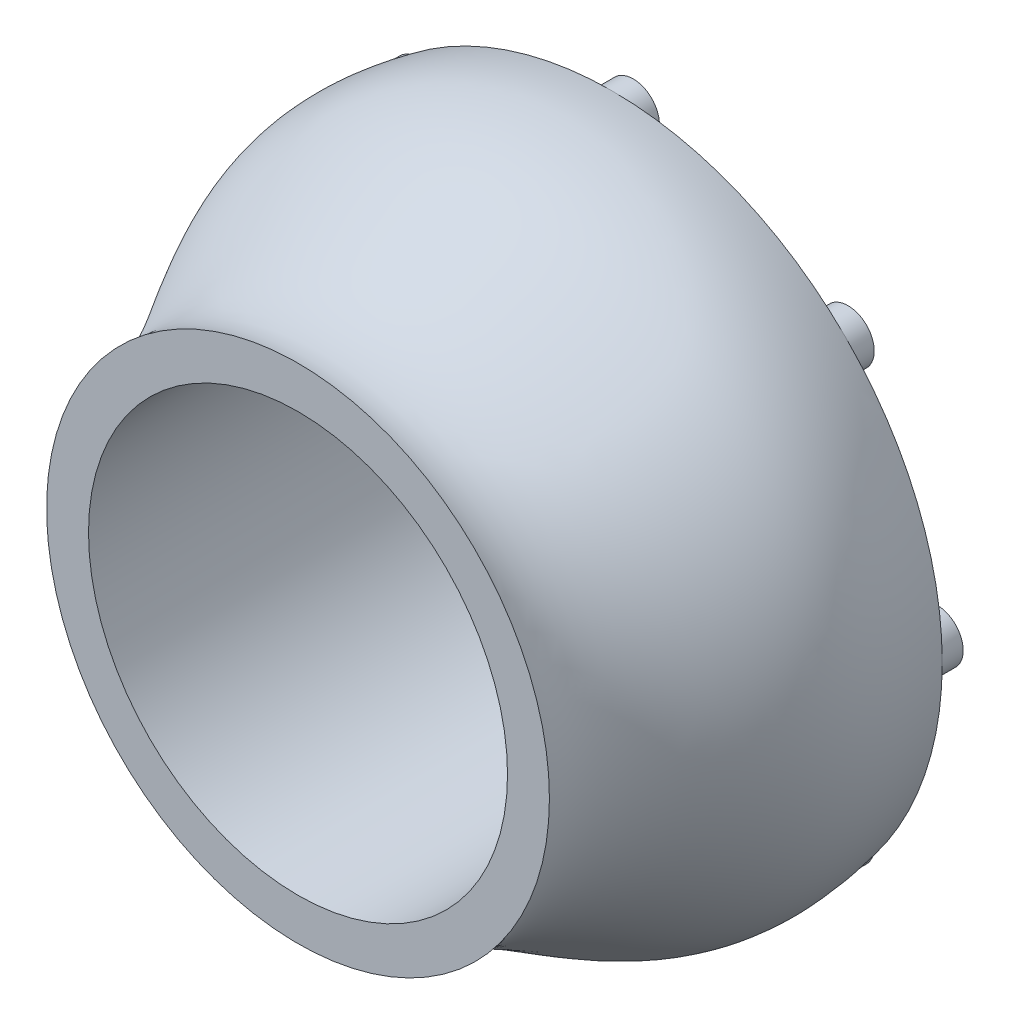
ISO-10303-21;
HEADER;
FILE_DESCRIPTION(('STEP AP214'),'2;1');
FILE_NAME('part.step','',(''),(''),'','','');
FILE_SCHEMA(('AUTOMOTIVE_DESIGN { 1 0 10303 214 1 1 1 1 }'));
ENDSEC;
DATA;
#1=APPLICATION_CONTEXT('core data for automotive mechanical design processes');
#2=APPLICATION_PROTOCOL_DEFINITION('international standard','automotive_design',2000,#1);
#3=PRODUCT_CONTEXT('',#1,'mechanical');
#4=PRODUCT('Part','Part','',(#3));
#5=PRODUCT_RELATED_PRODUCT_CATEGORY('part','',(#4));
#6=PRODUCT_DEFINITION_FORMATION('','',#4);
#7=PRODUCT_DEFINITION_CONTEXT('part definition',#1,'design');
#8=PRODUCT_DEFINITION('design','',#6,#7);
#9=PRODUCT_DEFINITION_SHAPE('','',#8);
#10=(LENGTH_UNIT() NAMED_UNIT(*) SI_UNIT(.MILLI.,.METRE.));
#11=(NAMED_UNIT(*) PLANE_ANGLE_UNIT() SI_UNIT($,.RADIAN.));
#12=(NAMED_UNIT(*) SI_UNIT($,.STERADIAN.) SOLID_ANGLE_UNIT());
#13=UNCERTAINTY_MEASURE_WITH_UNIT(LENGTH_MEASURE(1.E-05),#10,'distance_accuracy_value','');
#14=(GEOMETRIC_REPRESENTATION_CONTEXT(3) GLOBAL_UNCERTAINTY_ASSIGNED_CONTEXT((#13)) GLOBAL_UNIT_ASSIGNED_CONTEXT((#10,
#11,#12)) REPRESENTATION_CONTEXT('',''));
#15=CARTESIAN_POINT('',(0.,0.,0.));
#16=DIRECTION('',(0.,0.,1.));
#17=DIRECTION('',(1.,0.,0.));
#18=AXIS2_PLACEMENT_3D('',#15,#16,#17);
#19=CARTESIAN_POINT('',(0.,0.,0.));
#20=DIRECTION('',(0.,0.,1.));
#21=DIRECTION('',(1.,0.,0.));
#22=AXIS2_PLACEMENT_3D('',#19,#20,#21);
#23=PLANE('',#22);
#24=CARTESIAN_POINT('',(0.,0.,0.));
#25=DIRECTION('',(0.,0.,-1.));
#26=DIRECTION('',(-1.,0.,0.));
#27=AXIS2_PLACEMENT_3D('',#24,#25,#26);
#28=CIRCLE('',#27,20.);
#29=CARTESIAN_POINT('',(-20.,0.,0.));
#30=VERTEX_POINT('',#29);
#31=EDGE_CURVE('E412',#30,#30,#28,.T.);
#32=ORIENTED_EDGE('',*,*,#31,.F.);
#33=EDGE_LOOP('',(#32));
#34=FACE_BOUND('',#33,.T.);
#35=CARTESIAN_POINT('',(0.,0.,0.));
#36=DIRECTION('',(0.,0.,1.));
#37=DIRECTION('',(1.,0.,0.));
#38=AXIS2_PLACEMENT_3D('',#35,#36,#37);
#39=CIRCLE('',#38,31.5000000000018);
#40=CARTESIAN_POINT('',(22.2737929840219,22.2739342279094,0.));
#41=VERTEX_POINT('',#40);
#42=CARTESIAN_POINT('',(-4.33144647471246E-05,31.5000092623447,0.));
#43=VERTEX_POINT('',#42);
#44=EDGE_CURVE('E140',#41,#43,#39,.T.);
#45=ORIENTED_EDGE('',*,*,#44,.F.);
#46=CARTESIAN_POINT('',(20.5060966544095,20.506096654409,0.));
#47=DIRECTION('',(0.,0.,-1.));
#48=DIRECTION('',(-1.,0.,0.));
#49=AXIS2_PLACEMENT_3D('',#46,#47,#48);
#50=CIRCLE('',#49,2.50000000000095);
#51=EDGE_CURVE('E179',#41,#41,#50,.T.);
#52=ORIENTED_EDGE('',*,*,#51,.F.);
#53=CARTESIAN_POINT('',(31.4999999987557,7.88953098239609E-05,0.));
#54=VERTEX_POINT('',#53);
#55=EDGE_CURVE('E163',#54,#41,#39,.T.);
#56=ORIENTED_EDGE('',*,*,#55,.F.);
#57=CARTESIAN_POINT('',(28.9999999999988,-1.23456862236381E-12,0.));
#58=DIRECTION('',(0.,0.,-1.));
#59=DIRECTION('',(-1.,0.,0.));
#60=AXIS2_PLACEMENT_3D('',#57,#58,#59);
#61=CIRCLE('',#60,2.50000000000183);
#62=EDGE_CURVE('E397',#54,#54,#61,.T.);
#63=ORIENTED_EDGE('',*,*,#62,.F.);
#64=CARTESIAN_POINT('',(22.282916329209,-22.2647749915402,0.));
#65=VERTEX_POINT('',#64);
#66=EDGE_CURVE('E167',#65,#54,#39,.T.);
#67=ORIENTED_EDGE('',*,*,#66,.F.);
#68=CARTESIAN_POINT('',(20.5060966544078,-20.5060966544108,0.));
#69=DIRECTION('',(0.,0.,-1.));
#70=DIRECTION('',(-1.,0.,0.));
#71=AXIS2_PLACEMENT_3D('',#68,#69,#70);
#72=CIRCLE('',#71,2.50000000000251);
#73=CARTESIAN_POINT('',(22.264965307308,-22.2827276370392,0.));
#74=VERTEX_POINT('',#73);
#75=EDGE_CURVE('E353',#74,#65,#72,.T.);
#76=ORIENTED_EDGE('',*,*,#75,.F.);
#77=CARTESIAN_POINT('',(9.99348075282576E-05,-31.4999999980052,0.));
#78=VERTEX_POINT('',#77);
#79=EDGE_CURVE('E221',#78,#74,#39,.T.);
#80=ORIENTED_EDGE('',*,*,#79,.F.);
#81=CARTESIAN_POINT('',(-2.46203429329257E-12,-29.,0.));
#82=DIRECTION('',(0.,0.,-1.));
#83=DIRECTION('',(-1.,0.,0.));
#84=AXIS2_PLACEMENT_3D('',#81,#82,#83);
#85=CIRCLE('',#84,2.50000000000255);
#86=EDGE_CURVE('E356',#78,#78,#85,.T.);
#87=ORIENTED_EDGE('',*,*,#86,.F.);
#88=CARTESIAN_POINT('',(-22.2737929528265,-22.2739342591061,0.));
#89=VERTEX_POINT('',#88);
#90=EDGE_CURVE('E225',#89,#78,#39,.T.);
#91=ORIENTED_EDGE('',*,*,#90,.F.);
#92=CARTESIAN_POINT('',(-20.506096654412,-20.506096654409,0.));
#93=DIRECTION('',(0.,0.,-1.));
#94=DIRECTION('',(-1.,0.,0.));
#95=AXIS2_PLACEMENT_3D('',#92,#93,#94);
#96=CIRCLE('',#95,2.5000000000019);
#97=EDGE_CURVE('E373',#89,#89,#96,.T.);
#98=ORIENTED_EDGE('',*,*,#97,.F.);
#99=CARTESIAN_POINT('',(-31.5000068710482,-5.05668370192286E-05,0.));
#100=VERTEX_POINT('',#99);
#101=EDGE_CURVE('E392',#100,#89,#39,.T.);
#102=ORIENTED_EDGE('',*,*,#101,.F.);
#103=CARTESIAN_POINT('',(-29.0000000000012,1.23101714664628E-12,0.));
#104=DIRECTION('',(0.,0.,-1.));
#105=DIRECTION('',(-1.,0.,0.));
#106=AXIS2_PLACEMENT_3D('',#103,#104,#105);
#107=CIRCLE('',#106,2.50000000000092);
#108=EDGE_CURVE('E381',#100,#100,#107,.T.);
#109=ORIENTED_EDGE('',*,*,#108,.F.);
#110=CARTESIAN_POINT('',(-22.2739340583269,22.2737931536192,0.));
#111=VERTEX_POINT('',#110);
#112=EDGE_CURVE('E124',#111,#100,#39,.T.);
#113=ORIENTED_EDGE('',*,*,#112,.F.);
#114=CARTESIAN_POINT('',(-20.5060966544102,20.5060966544108,0.));
#115=DIRECTION('',(0.,0.,-1.));
#116=DIRECTION('',(-1.,0.,0.));
#117=AXIS2_PLACEMENT_3D('',#114,#115,#116);
#118=CIRCLE('',#117,2.50000000000014);
#119=EDGE_CURVE('E317',#111,#111,#118,.T.);
#120=ORIENTED_EDGE('',*,*,#119,.F.);
#121=EDGE_CURVE('E12',#43,#111,#39,.T.);
#122=ORIENTED_EDGE('',*,*,#121,.F.);
#123=CARTESIAN_POINT('',(0.,29.,0.));
#124=DIRECTION('',(0.,0.,-1.));
#125=DIRECTION('',(-1.,0.,0.));
#126=AXIS2_PLACEMENT_3D('',#123,#124,#125);
#127=CIRCLE('',#126,2.5);
#128=EDGE_CURVE('E181',#43,#43,#127,.T.);
#129=ORIENTED_EDGE('',*,*,#128,.F.);
#130=EDGE_LOOP('',(#45,#52,#56,#63,#67,#76,#80,#87,#91,#98,#102,#109,#113,#120,#122,#129));
#131=FACE_BOUND('',#130,.T.);
#132=ADVANCED_FACE('F115',(#34,#131),#23,.F.);
#133=CARTESIAN_POINT('',(0.,0.,30.));
#134=DIRECTION('',(0.,0.,1.));
#135=DIRECTION('',(1.,0.,0.));
#136=AXIS2_PLACEMENT_3D('',#133,#134,#135);
#137=PLANE('',#136);
#138=CARTESIAN_POINT('',(0.,0.,30.));
#139=DIRECTION('',(0.,0.,1.));
#140=DIRECTION('',(1.,0.,0.));
#141=AXIS2_PLACEMENT_3D('',#138,#139,#140);
#142=CIRCLE('',#141,20.);
#143=CARTESIAN_POINT('',(20.,0.,30.));
#144=VERTEX_POINT('',#143);
#145=EDGE_CURVE('E119',#144,#144,#142,.T.);
#146=ORIENTED_EDGE('',*,*,#145,.F.);
#147=EDGE_LOOP('',(#146));
#148=FACE_BOUND('',#147,.T.);
#149=CARTESIAN_POINT('',(0.,0.,30.));
#150=DIRECTION('',(0.,0.,1.));
#151=DIRECTION('',(1.,0.,0.));
#152=AXIS2_PLACEMENT_3D('',#149,#150,#151);
#153=CIRCLE('',#152,24.);
#154=CARTESIAN_POINT('',(24.,0.,30.));
#155=VERTEX_POINT('',#154);
#156=EDGE_CURVE('E182',#155,#155,#153,.T.);
#157=ORIENTED_EDGE('',*,*,#156,.T.);
#158=EDGE_LOOP('',(#157));
#159=FACE_BOUND('',#158,.T.);
#160=ADVANCED_FACE('F292',(#148,#159),#137,.T.);
#161=CARTESIAN_POINT('',(8.17226006122936,-22.5657742054563,30.));
#162=CARTESIAN_POINT('',(12.2462463436274,-20.3358943234867,27.1743109640882));
#163=CARTESIAN_POINT('',(18.3650531807604,-17.2462957535354,21.5574241412799));
#164=CARTESIAN_POINT('',(24.0696067194807,-21.9466994020287,10.4072407676802));
#165=CARTESIAN_POINT('',(23.0178719238098,-22.6190872167557,3.50927401928275));
#166=CARTESIAN_POINT('',(21.5845369252267,-22.9424882199738,0.));
#167=CARTESIAN_POINT('',(6.6953336825771,-23.1006473433217,30.));
#168=CARTESIAN_POINT('',(10.9152155212784,-21.137415561523,27.1743103825249));
#169=CARTESIAN_POINT('',(17.2363024765822,-18.4482840143075,21.5574242255509));
#170=CARTESIAN_POINT('',(22.6331967397162,-23.5220502971116,10.4072410201896));
#171=CARTESIAN_POINT('',(21.5374523240036,-24.1256064254355,3.50927343525123));
#172=CARTESIAN_POINT('',(20.0829546734728,-24.355192772701,0.));
#173=CARTESIAN_POINT('',(3.63629053057793,-23.8783004586063,30.));
#174=CARTESIAN_POINT('',(8.09562466375803,-22.4775851354522,27.1742960601731));
#175=CARTESIAN_POINT('',(14.7421419897276,-20.6299847146404,21.5574305598802));
#176=CARTESIAN_POINT('',(19.4501918653447,-26.3898344430555,10.4072366156752));
#177=CARTESIAN_POINT('',(18.2799934824636,-26.8470816844515,3.50927983101749));
#178=CARTESIAN_POINT('',(16.8016399288902,-26.88486639275,0.));
#179=CARTESIAN_POINT('',(-1.09252760508084,-24.1320104064838,30.));
#180=CARTESIAN_POINT('',(3.55446115438153,-23.6268861854048,27.1743235879626));
#181=CARTESIAN_POINT('',(10.4339668755966,-23.1095334472246,21.5574174867088));
#182=CARTESIAN_POINT('',(13.9280057862748,-29.6772929912708,10.407247322328));
#183=CARTESIAN_POINT('',(12.6910902467582,-29.8973774981688,3.50926315464398));
#184=CARTESIAN_POINT('',(11.2337536897232,-29.646067023508,0.));
#185=CARTESIAN_POINT('',(-5.77842933790616,-23.4508259107406,30.));
#186=CARTESIAN_POINT('',(-1.12243728734717,-23.8636660470968,27.1742982404886));
#187=CARTESIAN_POINT('',(5.7253675949735,-24.7008696007836,21.5574339554911));
#188=CARTESIAN_POINT('',(7.87061691961174,-31.8242979135194,10.4072264112701));
#189=CARTESIAN_POINT('',(6.61453189779017,-31.7989276377322,3.50930012873425));
#190=CARTESIAN_POINT('',(5.23427079203221,-31.2680462010341,0.));
#191=CARTESIAN_POINT('',(-10.2442406258479,-21.8775083764058,30.));
#192=CARTESIAN_POINT('',(-5.75782470993728,-23.1893238592667,27.1743690824351));
#193=CARTESIAN_POINT('',(0.795819482941087,-25.3443216265884,21.5573921275354));
#194=CARTESIAN_POINT('',(1.5108169227628,-32.7481170844811,10.4072743792576));
#195=CARTESIAN_POINT('',(0.283806229401346,-32.4781851243903,3.50921728130966));
#196=CARTESIAN_POINT('',(-0.966447136219214,-31.6883954191066,0.));
#197=CARTESIAN_POINT('',(-14.312787426856,-19.4548192085082,30.));
#198=CARTESIAN_POINT('',(-10.1689549686719,-21.6171225027547,27.1741426720217));
#199=CARTESIAN_POINT('',(-4.16261672514113,-25.009590367359,21.557506747528));
#200=CARTESIAN_POINT('',(-4.90725647775859,-32.4141365217913,10.4071686200411));
#201=CARTESIAN_POINT('',(-6.0579700510009,-31.909797650184,3.50938906072857));
#202=CARTESIAN_POINT('',(-7.12996316049374,-30.8909576877347,0.));
#203=CARTESIAN_POINT('',(-17.8366359038473,-16.2915382937594,30.));
#204=CARTESIAN_POINT('',(-14.1940894638347,-19.2214298897613,27.1745792802019));
#205=CARTESIAN_POINT('',(-8.96430427468925,-23.7222775267179,21.5572936329723));
#206=CARTESIAN_POINT('',(-11.1361915360607,-30.8329869237176,10.4073528159358));
#207=CARTESIAN_POINT('',(-12.1665807973692,-30.1143214486495,3.50909643243893));
#208=CARTESIAN_POINT('',(-13.0194823011768,-28.9064183962703,0.));
#209=CARTESIAN_POINT('',(-20.6683522197385,-12.4964455188713,30.));
#210=CARTESIAN_POINT('',(-17.6672553462177,-16.0793738810194,27.1740068053714));
#211=CARTESIAN_POINT('',(-13.4162109430247,-21.5110729978939,21.5575719649468));
#212=CARTESIAN_POINT('',(-16.9381089766256,-28.069181268796,10.4071140469438));
#213=CARTESIAN_POINT('',(-17.8081856677602,-27.1626974268891,3.50947475115738));
#214=CARTESIAN_POINT('',(-18.4086703160751,-25.8110182483186,0.));
#215=CARTESIAN_POINT('',(-22.7134015678594,-8.22579504153969,30.));
#216=CARTESIAN_POINT('',(-20.4693385832621,-12.3266902994052,27.1746027150096));
#217=CARTESIAN_POINT('',(-17.3600033579121,-18.4864477872035,21.5572816552804));
#218=CARTESIAN_POINT('',(-22.0877666247485,-24.2242669117266,10.4073640466106));
#219=CARTESIAN_POINT('',(-22.7647004838479,-23.1660307901023,3.50907809680494));
#220=CARTESIAN_POINT('',(-23.0904284716388,-21.7237199037882,0.));
#221=CARTESIAN_POINT('',(-23.8772491415398,-3.6358410194608,30.));
#222=CARTESIAN_POINT('',(-22.4757185186986,-8.09463847803613,27.174048265019));
#223=CARTESIAN_POINT('',(-20.6268988252185,-14.7399555203928,21.5575541522596));
#224=CARTESIAN_POINT('',(-26.3903673151322,-19.4505385368088,10.4071254908456));
#225=CARTESIAN_POINT('',(-26.847325259643,-18.2801337477795,3.5094587916851));
#226=CARTESIAN_POINT('',(-26.8848332116395,-16.8015934760946,0.));
#227=CARTESIAN_POINT('',(-24.1323286839775,1.09252693477723,30.));
#228=CARTESIAN_POINT('',(-23.6284120103854,-3.55495223859194,27.1745925807488));
#229=CARTESIAN_POINT('',(-23.1129687276402,-10.4356707568251,21.5572870587054));
#230=CARTESIAN_POINT('',(-29.6766628978114,-13.9277340250069,10.4073586319018));
#231=CARTESIAN_POINT('',(-29.897092884101,-12.690985025272,3.50908711752494));
#232=CARTESIAN_POINT('',(-29.6460774637329,-11.2337910594487,0.));
#233=CARTESIAN_POINT('',(-23.4510739383707,5.77841920858623,30.));
#234=CARTESIAN_POINT('',(-23.8625169624664,1.12272034996227,27.1740369041792));
#235=CARTESIAN_POINT('',(-24.6974417748212,-5.7241964951204,21.5575593849483));
#236=CARTESIAN_POINT('',(-31.8249208867963,-7.87085291841874,10.4071214779035));
#237=CARTESIAN_POINT('',(-31.7991941098095,-6.61465583058258,3.50946488046808));
#238=CARTESIAN_POINT('',(-31.2680311296658,-5.23428900630686,0.));
#239=CARTESIAN_POINT('',(-21.8772595027294,10.2443611501486,30.));
#240=CARTESIAN_POINT('',(-23.1901982997328,5.75780692438088,27.1745890743211));
#241=CARTESIAN_POINT('',(-25.3470999023149,-0.796397736342142,21.5572887804134));
#242=CARTESIAN_POINT('',(-32.7475975176717,-1.51079314017785,10.407357127242));
#243=CARTESIAN_POINT('',(-32.4779596530516,-0.283832371481994,3.50908951726695));
#244=CARTESIAN_POINT('',(-31.6884018215075,0.966377029895293,0.));
#245=CARTESIAN_POINT('',(-19.4546599750634,14.3128781076468,30.));
#246=CARTESIAN_POINT('',(-21.6164563153632,10.1690373777997,27.1740364734866));
#247=CARTESIAN_POINT('',(-25.0080463993939,4.16284128659287,21.5575592543869));
#248=CARTESIAN_POINT('',(-32.4144282451311,4.90718466933077,10.4071221462334));
#249=CARTESIAN_POINT('',(-31.9099358664128,6.05791350128995,3.50946350647043));
#250=CARTESIAN_POINT('',(-30.8909637620539,7.12993547461538,0.));
#251=CARTESIAN_POINT('',(-16.2916199496913,17.8366504202942,29.9999999999999));
#252=CARTESIAN_POINT('',(-19.2215731976843,14.1940884808196,27.1745933822877));
#253=CARTESIAN_POINT('',(-23.7225204165223,8.9642477077988,21.5572861005255));
#254=CARTESIAN_POINT('',(-30.8329497167271,11.1361845670594,10.4073603841694));
#255=CARTESIAN_POINT('',(-30.1143079881507,12.1665692320058,3.50908381429633));
#256=CARTESIAN_POINT('',(-28.9064260815685,13.0194679077553,0.));
#257=CARTESIAN_POINT('',(-12.4964840209315,20.6683584273043,30.));
#258=CARTESIAN_POINT('',(-16.0794882110885,17.6672184869826,27.1740357723676));
#259=CARTESIAN_POINT('',(-21.5113581299506,13.4161039552004,21.5575595972351));
#260=CARTESIAN_POINT('',(-28.0691307219518,16.9381283140131,10.4071218488943));
#261=CARTESIAN_POINT('',(-27.1626731944255,17.808199447015,3.50946397941701));
#262=CARTESIAN_POINT('',(-25.8110197182741,18.4086713458763,0.));
#263=CARTESIAN_POINT('',(-8.22573153989208,22.7134231183511,30.));
#264=CARTESIAN_POINT('',(-12.3265654876496,20.4693285456145,27.1745832767238));
#265=CARTESIAN_POINT('',(-18.4861952003575,17.3599529676282,21.5572910099932));
#266=CARTESIAN_POINT('',(-24.2243113186462,22.0877744405906,10.4073561787091));
#267=CARTESIAN_POINT('',(-23.1660522478689,22.7646999470131,3.50909047417013));
#268=CARTESIAN_POINT('',(-21.72371847275,23.0904261176251,0.));
#269=CARTESIAN_POINT('',(-3.63584185768116,23.8772654831087,30.));
#270=CARTESIAN_POINT('',(-8.09458366395763,22.4757303922661,27.1740326467065));
#271=CARTESIAN_POINT('',(-14.7397886175233,20.6268968342341,21.5575607370115));
#272=CARTESIAN_POINT('',(-19.4505690683085,26.3903712242279,10.4071214928013));
#273=CARTESIAN_POINT('',(-18.2801490482185,26.8473263412781,3.50946419156524));
#274=CARTESIAN_POINT('',(-16.8015932926403,26.8848355480617,0.));
#275=CARTESIAN_POINT('',(1.09243126320874,24.1323345894285,29.9999999999999));
#276=CARTESIAN_POINT('',(-3.5550432412596,23.6284271105557,27.17459406556));
#277=CARTESIAN_POINT('',(-10.435755367451,23.112997322455,21.5572855931957));
#278=CARTESIAN_POINT('',(-13.9277046867296,29.676665019048,10.4073611059754));
#279=CARTESIAN_POINT('',(-12.6909612551581,29.8970979363873,3.50908250832558));
#280=CARTESIAN_POINT('',(-11.2337780845803,29.6460831031126,0.));
#281=CARTESIAN_POINT('',(5.77833406028507,23.4510795051622,30.));
#282=CARTESIAN_POINT('',(1.12265188045321,23.862529033114,27.1740340863822));
#283=CARTESIAN_POINT('',(-5.7242320897045,24.6974613178995,21.5575599297728));
#284=CARTESIAN_POINT('',(-7.87081109642013,31.8249274479909,10.4071223608574));
#285=CARTESIAN_POINT('',(-6.61461601859544,31.7992009974245,3.50946271674578));
#286=CARTESIAN_POINT('',(-5.234257603155,31.2680375042074,0.));
#287=CARTESIAN_POINT('',(10.2443141901107,21.8772814924234,30.));
#288=CARTESIAN_POINT('',(5.75779410979146,23.1902130675586,27.1745811211242));
#289=CARTESIAN_POINT('',(-0.796345857111786,25.3470924742524,21.5572915209752));
#290=CARTESIAN_POINT('',(-1.51072870914053,32.7476025562824,10.4073566192151));
#291=CARTESIAN_POINT('',(-0.283765756427531,32.4779602630114,3.50908927849503));
#292=CARTESIAN_POINT('',(0.966440391867609,31.6883998891424,0.));
#293=CARTESIAN_POINT('',(14.3128193092484,19.4547218133258,30.));
#294=CARTESIAN_POINT('',(10.1689819680399,21.6164835459831,27.1740309020518));
#295=CARTESIAN_POINT('',(4.16280023583499,25.0080125388304,21.5575612065673));
#296=CARTESIAN_POINT('',(4.90722849853735,32.4144280602912,10.4071217096787));
#297=CARTESIAN_POINT('',(6.05795345933092,31.9099299345882,3.5094634969904));
#298=CARTESIAN_POINT('',(7.12996643095598,30.89095548572,0.));
#299=CARTESIAN_POINT('',(17.8365846234669,16.2916896540734,30.));
#300=CARTESIAN_POINT('',(14.1940088953624,19.2216035939596,27.1745854489733));
#301=CARTESIAN_POINT('',(8.9641581410717,23.7224774844128,21.5572893094253));
#302=CARTESIAN_POINT('',(11.13621561019,30.8329519881316,10.4073586921458));
#303=CARTESIAN_POINT('',(12.1665932348897,30.1143036182523,3.50908589450615));
#304=CARTESIAN_POINT('',(13.0194805148593,28.9064196620094,0.));
#305=CARTESIAN_POINT('',(20.668345338535,12.4964742008702,30.));
#306=CARTESIAN_POINT('',(17.6672773575276,16.0794858192682,27.1740292966529));
#307=CARTESIAN_POINT('',(13.4162691696584,21.5113530617596,21.5575615876165));
#308=CARTESIAN_POINT('',(16.9380985305032,28.0691287438661,10.4071220365228));
#309=CARTESIAN_POINT('',(17.8081839369827,27.1626714168537,3.50946260890068));
#310=CARTESIAN_POINT('',(18.4086713866131,25.8110173750145,0.));
#311=CARTESIAN_POINT('',(22.7134472269592,8.2256689646737,30.));
#312=CARTESIAN_POINT('',(20.4694493972924,12.3265422322444,27.174592992162));
#313=CARTESIAN_POINT('',(17.3602079707753,18.4862513288557,21.557285904088));
#314=CARTESIAN_POINT('',(22.0877294187843,24.2243026809462,10.4073611845389));
#315=CARTESIAN_POINT('',(22.7646780667628,23.1660521360562,3.50908218831531));
#316=CARTESIAN_POINT('',(23.0904276894521,21.7237207351849,0.));
#317=CARTESIAN_POINT('',(23.8772360612462,3.63586745644145,30.));
#318=CARTESIAN_POINT('',(22.4755957359787,8.0946360448613,27.174042655026));
#319=CARTESIAN_POINT('',(20.6266213672169,14.7398966964314,21.557557752821));
#320=CARTESIAN_POINT('',(26.390419215097,19.4505488490673,10.4071209734035));
#321=CARTESIAN_POINT('',(26.8473516190517,18.2801362644551,3.50946675845606));
#322=CARTESIAN_POINT('',(26.8848340180841,16.8015923543288,0.));
#323=CARTESIAN_POINT('',(24.1322711530059,-1.09237783813286,30.));
#324=CARTESIAN_POINT('',(23.6282994934639,3.555107030538,27.174571540765));
#325=CARTESIAN_POINT('',(23.1127509280115,10.4357959737268,21.5572961390736));
#326=CARTESIAN_POINT('',(29.6767014258934,13.9277144015705,10.4073527226515));
#327=CARTESIAN_POINT('',(29.8971112047568,12.690972877701,3.50909541555513));
#328=CARTESIAN_POINT('',(29.6460763092005,11.233792919578,0.));
#329=CARTESIAN_POINT('',(23.4511118138481,-5.77851443335552,30.));
#330=CARTESIAN_POINT('',(23.8631428483065,-1.12290355206301,27.1741235495122));
#331=CARTESIAN_POINT('',(24.6990196777455,5.72403256214138,21.5575153233354));
#332=CARTESIAN_POINT('',(31.8246302689558,7.87087776131291,10.4071624437277));
#333=CARTESIAN_POINT('',(31.7990606341216,6.6146701761541,3.50939817827765));
#334=CARTESIAN_POINT('',(31.2680331282933,5.23428560773673,0.));
#335=CARTESIAN_POINT('',(21.8773482769793,-10.2445825257903,30.));
#336=CARTESIAN_POINT('',(23.1892146508273,-5.7576404416089,27.174456188281));
#337=CARTESIAN_POINT('',(25.3443738657759,0.796936634175067,21.5573598421976));
#338=CARTESIAN_POINT('',(32.7481003499637,1.5106999365685,10.4072856050627));
#339=CARTESIAN_POINT('',(32.4781861987319,0.283795492524829,3.50920882203617));
#340=CARTESIAN_POINT('',(31.6883977707651,-0.966370025683239,0.));
#341=CARTESIAN_POINT('',(19.4545707756058,-14.3126223120009,30.));
#342=CARTESIAN_POINT('',(21.6176542800761,-10.1694379356964,27.174215224769));
#343=CARTESIAN_POINT('',(25.0114079984618,-4.16398591630195,21.5574649022874));
#344=CARTESIAN_POINT('',(32.41381187439,-4.90698553116875,10.4072152699846));
#345=CARTESIAN_POINT('',(31.9096602000695,-6.05783356813801,3.50930905651692));
#346=CARTESIAN_POINT('',(30.8909716390171,-7.12994916894729,0.));
#347=CARTESIAN_POINT('',(16.2914863681489,-17.8363397238033,30.));
#348=CARTESIAN_POINT('',(19.2202454265714,-14.1931121902328,27.1743606993669));
#349=CARTESIAN_POINT('',(23.7190229603958,-8.96251907695161,21.5574034558861));
#350=CARTESIAN_POINT('',(30.8335810963229,-11.1364758187264,10.407252792682));
#351=CARTESIAN_POINT('',(30.1145903846396,-12.1666941130705,3.50925820561746));
#352=CARTESIAN_POINT('',(28.9064115184158,-13.0194425783784,0.));
#353=CARTESIAN_POINT('',(12.4968021130301,-20.6694406930137,30.));
#354=CARTESIAN_POINT('',(16.0807629083908,-17.6688367688347,27.1742995495529));
#355=CARTESIAN_POINT('',(21.5145929106122,-13.4183286710555,21.5574300542546));
#356=CARTESIAN_POINT('',(28.0685677291725,-16.937775279827,10.4072351006186));
#357=CARTESIAN_POINT('',(27.1624253056167,-17.8080471310488,3.5092833352066));
#358=CARTESIAN_POINT('',(25.8110476637293,-18.408719775063,0.));
#359=CARTESIAN_POINT('',(9.64918643988163,-22.0309010675908,30.));
#360=CARTESIAN_POINT('',(13.5772771659764,-19.5343730854504,27.1743115456515));
#361=CARTESIAN_POINT('',(19.4938038849387,-16.0443074927633,21.557424057009));
#362=CARTESIAN_POINT('',(25.5060166992452,-20.3713485069458,10.4072405151707));
#363=CARTESIAN_POINT('',(24.498291523616,-21.1125680080759,3.50927460331426));
#364=CARTESIAN_POINT('',(23.0861191769806,-21.5297836672466,0.));
#365=CARTESIAN_POINT('',(8.17226006122936,-22.5657742054563,30.));
#366=CARTESIAN_POINT('',(12.2462463436274,-20.3358943234867,27.1743109640882));
#367=CARTESIAN_POINT('',(18.3650531807604,-17.2462957535354,21.5574241412799));
#368=CARTESIAN_POINT('',(24.0696067194807,-21.9466994020287,10.4072407676802));
#369=CARTESIAN_POINT('',(23.0178719238098,-22.6190872167557,3.50927401928275));
#370=CARTESIAN_POINT('',(21.5845369252267,-22.9424882199738,0.));
#371=B_SPLINE_SURFACE_WITH_KNOTS('',3,3,((#161,#162,#163,#164,#165,#166),(#167,#168,#169,#170,
#171,#172),(#173,#174,#175,#176,#177,#178),(#179,#180,#181,#182,#183,#184),(#185,#186,#187,#188,
#189,#190),(#191,#192,#193,#194,#195,#196),(#197,#198,#199,#200,#201,#202),(#203,#204,#205,#206,
#207,#208),(#209,#210,#211,#212,#213,#214),(#215,#216,#217,#218,#219,#220),(#221,#222,#223,#224,
#225,#226),(#227,#228,#229,#230,#231,#232),(#233,#234,#235,#236,#237,#238),(#239,#240,#241,#242,
#243,#244),(#245,#246,#247,#248,#249,#250),(#251,#252,#253,#254,#255,#256),(#257,#258,#259,#260,
#261,#262),(#263,#264,#265,#266,#267,#268),(#269,#270,#271,#272,#273,#274),(#275,#276,#277,#278,
#279,#280),(#281,#282,#283,#284,#285,#286),(#287,#288,#289,#290,#291,#292),(#293,#294,#295,#296,
#297,#298),(#299,#300,#301,#302,#303,#304),(#305,#306,#307,#308,#309,#310),(#311,#312,#313,#314,
#315,#316),(#317,#318,#319,#320,#321,#322),(#323,#324,#325,#326,#327,#328),(#329,#330,#331,#332,
#333,#334),(#335,#336,#337,#338,#339,#340),(#341,#342,#343,#344,#345,#346),(#347,#348,#349,#350,
#351,#352),(#353,#354,#355,#356,#357,#358),(#359,#360,#361,#362,#363,#364),(#365,#366,#367,#368,
#369,#370)),.UNSPECIFIED.,.T.,.F.,.F.,(4,1,1,1,1,1,1,1,1,1,1,1,1,1,1,1,1,1,1,1,1,1,1,1,1,1,1,1,
1,1,1,1,4),(4,1,1,4),(0.,0.03125,0.0625,0.09375,0.125,0.15625,0.1875,0.21875,0.25,0.28125,
0.3125,0.34375,0.375,0.40625,0.4375,0.46875,0.5,0.53125,0.5625,0.59375,0.625,0.65625,0.6875,
0.71875,0.75,0.78125,0.8125,0.84375,0.875,0.90625,0.9375,0.96875,1.),(0.,0.409424710319192,
0.719115108218135,1.),.UNSPECIFIED.);
#372=CARTESIAN_POINT('',(22.2739262995562,-22.2738009129752,0.));
#373=VERTEX_POINT('',#372);
#374=EDGE_CURVE('E220',#74,#373,#39,.T.);
#375=EDGE_CURVE('E132',#65,#373,#72,.T.);
#376=ORIENTED_EDGE('',*,*,#156,.F.);
#377=EDGE_LOOP('',(#376));
#378=FACE_BOUND('',#377,.T.);
#379=ORIENTED_EDGE('',*,*,#121,.T.);
#380=ORIENTED_EDGE('',*,*,#112,.T.);
#381=ORIENTED_EDGE('',*,*,#101,.T.);
#382=ORIENTED_EDGE('',*,*,#90,.T.);
#383=ORIENTED_EDGE('',*,*,#79,.T.);
#384=ORIENTED_EDGE('',*,*,#374,.T.);
#385=ORIENTED_EDGE('',*,*,#375,.F.);
#386=ORIENTED_EDGE('',*,*,#66,.T.);
#387=ORIENTED_EDGE('',*,*,#55,.T.);
#388=ORIENTED_EDGE('',*,*,#44,.T.);
#389=EDGE_LOOP('',(#379,#380,#381,#382,#383,#384,#385,#386,#387,#388));
#390=FACE_BOUND('',#389,.T.);
#391=ADVANCED_FACE('F165',(#378,#390),#371,.T.);
#392=CARTESIAN_POINT('',(0.,29.,-2.));
#393=DIRECTION('',(0.,0.,1.));
#394=DIRECTION('',(1.,0.,0.));
#395=AXIS2_PLACEMENT_3D('',#392,#393,#394);
#396=CYLINDRICAL_SURFACE('',#395,2.5);
#397=CARTESIAN_POINT('',(0.,29.,-2.));
#398=DIRECTION('',(0.,0.,-1.));
#399=DIRECTION('',(-1.,0.,0.));
#400=AXIS2_PLACEMENT_3D('',#397,#398,#399);
#401=CIRCLE('',#400,2.5);
#402=CARTESIAN_POINT('',(-2.5,29.,-2.));
#403=VERTEX_POINT('',#402);
#404=EDGE_CURVE('E310',#403,#403,#401,.T.);
#405=ORIENTED_EDGE('',*,*,#404,.F.);
#406=EDGE_LOOP('',(#405));
#407=FACE_BOUND('',#406,.T.);
#408=ORIENTED_EDGE('',*,*,#128,.T.);
#409=EDGE_LOOP('',(#408));
#410=FACE_BOUND('',#409,.T.);
#411=ADVANCED_FACE('F287',(#407,#410),#396,.T.);
#412=CARTESIAN_POINT('',(0.,29.,-2.));
#413=DIRECTION('',(0.,0.,-1.));
#414=DIRECTION('',(-1.,0.,0.));
#415=AXIS2_PLACEMENT_3D('',#412,#413,#414);
#416=PLANE('',#415);
#417=ORIENTED_EDGE('',*,*,#404,.T.);
#418=EDGE_LOOP('',(#417));
#419=FACE_BOUND('',#418,.T.);
#420=ADVANCED_FACE('F280',(#419),#416,.T.);
#421=CARTESIAN_POINT('',(-20.5060966544102,20.5060966544108,-2.));
#422=DIRECTION('',(0.,0.,1.));
#423=DIRECTION('',(1.,0.,0.));
#424=AXIS2_PLACEMENT_3D('',#421,#422,#423);
#425=CYLINDRICAL_SURFACE('',#424,2.50000000000014);
#426=CARTESIAN_POINT('',(-20.5060966544102,20.5060966544108,-2.));
#427=DIRECTION('',(0.,0.,-1.));
#428=DIRECTION('',(-1.,0.,0.));
#429=AXIS2_PLACEMENT_3D('',#426,#427,#428);
#430=CIRCLE('',#429,2.50000000000014);
#431=CARTESIAN_POINT('',(-23.0060966544104,20.5060966544108,-2.));
#432=VERTEX_POINT('',#431);
#433=EDGE_CURVE('E384',#432,#432,#430,.T.);
#434=ORIENTED_EDGE('',*,*,#433,.F.);
#435=EDGE_LOOP('',(#434));
#436=FACE_BOUND('',#435,.T.);
#437=ORIENTED_EDGE('',*,*,#119,.T.);
#438=EDGE_LOOP('',(#437));
#439=FACE_BOUND('',#438,.T.);
#440=ADVANCED_FACE('F277',(#436,#439),#425,.T.);
#441=CARTESIAN_POINT('',(-20.5060966544102,20.5060966544108,-2.));
#442=DIRECTION('',(0.,0.,-1.));
#443=DIRECTION('',(-1.,0.,0.));
#444=AXIS2_PLACEMENT_3D('',#441,#442,#443);
#445=PLANE('',#444);
#446=ORIENTED_EDGE('',*,*,#433,.T.);
#447=EDGE_LOOP('',(#446));
#448=FACE_BOUND('',#447,.T.);
#449=ADVANCED_FACE('F272',(#448),#445,.T.);
#450=CARTESIAN_POINT('',(-29.0000000000012,1.23101714664628E-12,-2.));
#451=DIRECTION('',(0.,0.,1.));
#452=DIRECTION('',(1.,0.,0.));
#453=AXIS2_PLACEMENT_3D('',#450,#451,#452);
#454=CYLINDRICAL_SURFACE('',#453,2.50000000000092);
#455=CARTESIAN_POINT('',(-29.0000000000012,1.23101714664628E-12,-2.));
#456=DIRECTION('',(0.,0.,-1.));
#457=DIRECTION('',(-1.,0.,0.));
#458=AXIS2_PLACEMENT_3D('',#455,#456,#457);
#459=CIRCLE('',#458,2.50000000000092);
#460=CARTESIAN_POINT('',(-31.5000000000021,1.23101714664628E-12,-2.));
#461=VERTEX_POINT('',#460);
#462=EDGE_CURVE('E376',#461,#461,#459,.T.);
#463=ORIENTED_EDGE('',*,*,#462,.F.);
#464=EDGE_LOOP('',(#463));
#465=FACE_BOUND('',#464,.T.);
#466=ORIENTED_EDGE('',*,*,#108,.T.);
#467=EDGE_LOOP('',(#466));
#468=FACE_BOUND('',#467,.T.);
#469=ADVANCED_FACE('F269',(#465,#468),#454,.T.);
#470=CARTESIAN_POINT('',(-29.0000000000012,1.23101714664628E-12,-2.));
#471=DIRECTION('',(0.,0.,-1.));
#472=DIRECTION('',(-1.,0.,0.));
#473=AXIS2_PLACEMENT_3D('',#470,#471,#472);
#474=PLANE('',#473);
#475=ORIENTED_EDGE('',*,*,#462,.T.);
#476=EDGE_LOOP('',(#475));
#477=FACE_BOUND('',#476,.T.);
#478=ADVANCED_FACE('F264',(#477),#474,.T.);
#479=CARTESIAN_POINT('',(-20.506096654412,-20.506096654409,-2.));
#480=DIRECTION('',(0.,0.,1.));
#481=DIRECTION('',(1.,0.,0.));
#482=AXIS2_PLACEMENT_3D('',#479,#480,#481);
#483=CYLINDRICAL_SURFACE('',#482,2.5000000000019);
#484=CARTESIAN_POINT('',(-20.506096654412,-20.506096654409,-2.));
#485=DIRECTION('',(0.,0.,-1.));
#486=DIRECTION('',(-1.,0.,0.));
#487=AXIS2_PLACEMENT_3D('',#484,#485,#486);
#488=CIRCLE('',#487,2.5000000000019);
#489=CARTESIAN_POINT('',(-23.0060966544139,-20.506096654409,-2.));
#490=VERTEX_POINT('',#489);
#491=EDGE_CURVE('E368',#490,#490,#488,.T.);
#492=ORIENTED_EDGE('',*,*,#491,.F.);
#493=EDGE_LOOP('',(#492));
#494=FACE_BOUND('',#493,.T.);
#495=ORIENTED_EDGE('',*,*,#97,.T.);
#496=EDGE_LOOP('',(#495));
#497=FACE_BOUND('',#496,.T.);
#498=ADVANCED_FACE('F261',(#494,#497),#483,.T.);
#499=CARTESIAN_POINT('',(-20.506096654412,-20.506096654409,-2.));
#500=DIRECTION('',(0.,0.,-1.));
#501=DIRECTION('',(-1.,0.,0.));
#502=AXIS2_PLACEMENT_3D('',#499,#500,#501);
#503=PLANE('',#502);
#504=ORIENTED_EDGE('',*,*,#491,.T.);
#505=EDGE_LOOP('',(#504));
#506=FACE_BOUND('',#505,.T.);
#507=ADVANCED_FACE('F256',(#506),#503,.T.);
#508=CARTESIAN_POINT('',(-2.46203429329257E-12,-29.,-2.));
#509=DIRECTION('',(0.,0.,1.));
#510=DIRECTION('',(1.,0.,0.));
#511=AXIS2_PLACEMENT_3D('',#508,#509,#510);
#512=CYLINDRICAL_SURFACE('',#511,2.50000000000255);
#513=CARTESIAN_POINT('',(-2.46203429329257E-12,-29.,-2.));
#514=DIRECTION('',(0.,0.,-1.));
#515=DIRECTION('',(-1.,0.,0.));
#516=AXIS2_PLACEMENT_3D('',#513,#514,#515);
#517=CIRCLE('',#516,2.50000000000255);
#518=CARTESIAN_POINT('',(-2.50000000000501,-29.,-2.));
#519=VERTEX_POINT('',#518);
#520=EDGE_CURVE('E352',#519,#519,#517,.T.);
#521=ORIENTED_EDGE('',*,*,#520,.F.);
#522=EDGE_LOOP('',(#521));
#523=FACE_BOUND('',#522,.T.);
#524=ORIENTED_EDGE('',*,*,#86,.T.);
#525=EDGE_LOOP('',(#524));
#526=FACE_BOUND('',#525,.T.);
#527=ADVANCED_FACE('F253',(#523,#526),#512,.T.);
#528=CARTESIAN_POINT('',(-2.46203429329257E-12,-29.,-2.));
#529=DIRECTION('',(0.,0.,-1.));
#530=DIRECTION('',(-1.,0.,0.));
#531=AXIS2_PLACEMENT_3D('',#528,#529,#530);
#532=PLANE('',#531);
#533=ORIENTED_EDGE('',*,*,#520,.T.);
#534=EDGE_LOOP('',(#533));
#535=FACE_BOUND('',#534,.T.);
#536=ADVANCED_FACE('F244',(#535),#532,.T.);
#537=CARTESIAN_POINT('',(20.5060966544078,-20.5060966544108,-2.));
#538=DIRECTION('',(0.,0.,1.));
#539=DIRECTION('',(1.,0.,0.));
#540=AXIS2_PLACEMENT_3D('',#537,#538,#539);
#541=CYLINDRICAL_SURFACE('',#540,2.50000000000251);
#542=CARTESIAN_POINT('',(20.5060966544078,-20.5060966544108,-2.));
#543=DIRECTION('',(0.,0.,-1.));
#544=DIRECTION('',(-1.,0.,0.));
#545=AXIS2_PLACEMENT_3D('',#542,#543,#544);
#546=CIRCLE('',#545,2.50000000000251);
#547=CARTESIAN_POINT('',(18.0060966544053,-20.5060966544108,-2.));
#548=VERTEX_POINT('',#547);
#549=EDGE_CURVE('E358',#548,#548,#546,.T.);
#550=ORIENTED_EDGE('',*,*,#549,.F.);
#551=EDGE_LOOP('',(#550));
#552=FACE_BOUND('',#551,.T.);
#553=ORIENTED_EDGE('',*,*,#375,.T.);
#554=ORIENTED_EDGE('',*,*,#374,.F.);
#555=ORIENTED_EDGE('',*,*,#75,.T.);
#556=EDGE_LOOP('',(#553,#554,#555));
#557=FACE_BOUND('',#556,.T.);
#558=ADVANCED_FACE('F233',(#552,#557),#541,.T.);
#559=CARTESIAN_POINT('',(20.5060966544078,-20.5060966544108,-2.));
#560=DIRECTION('',(0.,0.,-1.));
#561=DIRECTION('',(-1.,0.,0.));
#562=AXIS2_PLACEMENT_3D('',#559,#560,#561);
#563=PLANE('',#562);
#564=ORIENTED_EDGE('',*,*,#549,.T.);
#565=EDGE_LOOP('',(#564));
#566=FACE_BOUND('',#565,.T.);
#567=ADVANCED_FACE('F243',(#566),#563,.T.);
#568=CARTESIAN_POINT('',(28.9999999999988,-1.23456862236381E-12,-2.));
#569=DIRECTION('',(0.,0.,1.));
#570=DIRECTION('',(1.,0.,0.));
#571=AXIS2_PLACEMENT_3D('',#568,#569,#570);
#572=CYLINDRICAL_SURFACE('',#571,2.50000000000183);
#573=CARTESIAN_POINT('',(28.9999999999988,-1.23456862236381E-12,-2.));
#574=DIRECTION('',(0.,0.,-1.));
#575=DIRECTION('',(-1.,0.,0.));
#576=AXIS2_PLACEMENT_3D('',#573,#574,#575);
#577=CIRCLE('',#576,2.50000000000183);
#578=CARTESIAN_POINT('',(26.4999999999969,-1.23456862236381E-12,-2.));
#579=VERTEX_POINT('',#578);
#580=EDGE_CURVE('E399',#579,#579,#577,.T.);
#581=ORIENTED_EDGE('',*,*,#580,.F.);
#582=EDGE_LOOP('',(#581));
#583=FACE_BOUND('',#582,.T.);
#584=ORIENTED_EDGE('',*,*,#62,.T.);
#585=EDGE_LOOP('',(#584));
#586=FACE_BOUND('',#585,.T.);
#587=ADVANCED_FACE('F251',(#583,#586),#572,.T.);
#588=CARTESIAN_POINT('',(28.9999999999988,-1.23456862236381E-12,-2.));
#589=DIRECTION('',(0.,0.,-1.));
#590=DIRECTION('',(-1.,0.,0.));
#591=AXIS2_PLACEMENT_3D('',#588,#589,#590);
#592=PLANE('',#591);
#593=ORIENTED_EDGE('',*,*,#580,.T.);
#594=EDGE_LOOP('',(#593));
#595=FACE_BOUND('',#594,.T.);
#596=ADVANCED_FACE('F246',(#595),#592,.T.);
#597=CARTESIAN_POINT('',(20.5060966544095,20.506096654409,-2.));
#598=DIRECTION('',(0.,0.,1.));
#599=DIRECTION('',(1.,0.,0.));
#600=AXIS2_PLACEMENT_3D('',#597,#598,#599);
#601=CYLINDRICAL_SURFACE('',#600,2.50000000000095);
#602=CARTESIAN_POINT('',(20.5060966544095,20.506096654409,-2.));
#603=DIRECTION('',(0.,0.,-1.));
#604=DIRECTION('',(-1.,0.,0.));
#605=AXIS2_PLACEMENT_3D('',#602,#603,#604);
#606=CIRCLE('',#605,2.50000000000095);
#607=CARTESIAN_POINT('',(18.0060966544086,20.506096654409,-2.));
#608=VERTEX_POINT('',#607);
#609=EDGE_CURVE('E409',#608,#608,#606,.T.);
#610=ORIENTED_EDGE('',*,*,#609,.F.);
#611=EDGE_LOOP('',(#610));
#612=FACE_BOUND('',#611,.T.);
#613=ORIENTED_EDGE('',*,*,#51,.T.);
#614=EDGE_LOOP('',(#613));
#615=FACE_BOUND('',#614,.T.);
#616=ADVANCED_FACE('F426',(#612,#615),#601,.T.);
#617=CARTESIAN_POINT('',(20.5060966544095,20.506096654409,-2.));
#618=DIRECTION('',(0.,0.,-1.));
#619=DIRECTION('',(-1.,0.,0.));
#620=AXIS2_PLACEMENT_3D('',#617,#618,#619);
#621=PLANE('',#620);
#622=ORIENTED_EDGE('',*,*,#609,.T.);
#623=EDGE_LOOP('',(#622));
#624=FACE_BOUND('',#623,.T.);
#625=ADVANCED_FACE('F421',(#624),#621,.T.);
#626=CARTESIAN_POINT('',(0.,0.,30.011175882275));
#627=DIRECTION('',(0.,0.,-1.));
#628=DIRECTION('',(-1.,0.,0.));
#629=AXIS2_PLACEMENT_3D('',#626,#627,#628);
#630=CYLINDRICAL_SURFACE('',#629,20.);
#631=ORIENTED_EDGE('',*,*,#145,.T.);
#632=EDGE_LOOP('',(#631));
#633=FACE_BOUND('',#632,.T.);
#634=ORIENTED_EDGE('',*,*,#31,.T.);
#635=EDGE_LOOP('',(#634));
#636=FACE_BOUND('',#635,.T.);
#637=ADVANCED_FACE('F419',(#633,#636),#630,.F.);
#638=CLOSED_SHELL('',(#132,#160,#391,#411,#420,#440,#449,#469,#478,#498,#507,#527,#536,#558,
#567,#587,#596,#616,#625,#637));
#639=MANIFOLD_SOLID_BREP('B2',#638);
#640=ADVANCED_BREP_SHAPE_REPRESENTATION('',(#18,#639),#14);
#641=SHAPE_DEFINITION_REPRESENTATION(#9,#640);
ENDSEC;
END-ISO-10303-21;
